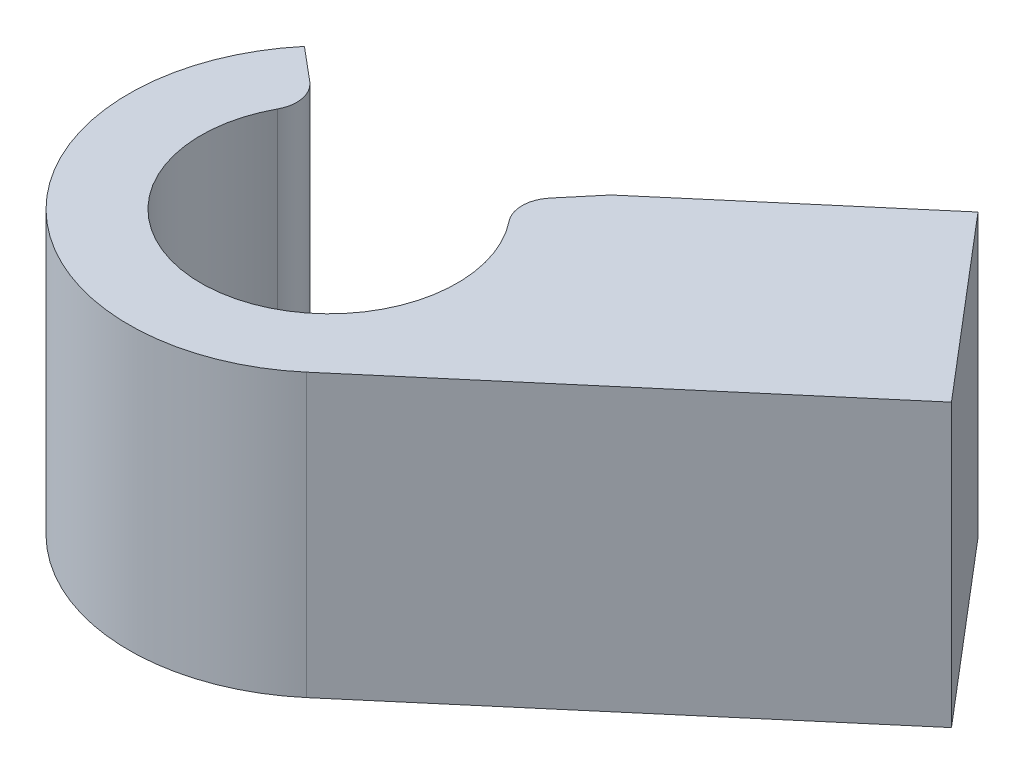
ISO-10303-21;
HEADER;
FILE_DESCRIPTION(('STEP AP214'),'2;1');
FILE_NAME('part.step','',(''),(''),'','','');
FILE_SCHEMA(('AUTOMOTIVE_DESIGN { 1 0 10303 214 1 1 1 1 }'));
ENDSEC;
DATA;
#1=APPLICATION_CONTEXT('core data for automotive mechanical design processes');
#2=APPLICATION_PROTOCOL_DEFINITION('international standard','automotive_design',2000,#1);
#3=PRODUCT_CONTEXT('',#1,'mechanical');
#4=PRODUCT('Part','Part','',(#3));
#5=PRODUCT_RELATED_PRODUCT_CATEGORY('part','',(#4));
#6=PRODUCT_DEFINITION_FORMATION('','',#4);
#7=PRODUCT_DEFINITION_CONTEXT('part definition',#1,'design');
#8=PRODUCT_DEFINITION('design','',#6,#7);
#9=PRODUCT_DEFINITION_SHAPE('','',#8);
#10=(LENGTH_UNIT() NAMED_UNIT(*) SI_UNIT(.MILLI.,.METRE.));
#11=(NAMED_UNIT(*) PLANE_ANGLE_UNIT() SI_UNIT($,.RADIAN.));
#12=(NAMED_UNIT(*) SI_UNIT($,.STERADIAN.) SOLID_ANGLE_UNIT());
#13=UNCERTAINTY_MEASURE_WITH_UNIT(LENGTH_MEASURE(1.E-05),#10,'distance_accuracy_value','');
#14=(GEOMETRIC_REPRESENTATION_CONTEXT(3) GLOBAL_UNCERTAINTY_ASSIGNED_CONTEXT((#13)) GLOBAL_UNIT_ASSIGNED_CONTEXT((#10,
#11,#12)) REPRESENTATION_CONTEXT('',''));
#15=CARTESIAN_POINT('',(0.,0.,0.));
#16=DIRECTION('',(0.,0.,1.));
#17=DIRECTION('',(1.,0.,0.));
#18=AXIS2_PLACEMENT_3D('',#15,#16,#17);
#19=CARTESIAN_POINT('',(0.,17.6,0.));
#20=DIRECTION('',(0.,-1.,0.));
#21=DIRECTION('',(0.,0.,-1.));
#22=AXIS2_PLACEMENT_3D('',#19,#20,#21);
#23=CYLINDRICAL_SURFACE('',#22,12.5);
#24=DIRECTION('',(0.,1.,0.));
#25=VECTOR('',#24,1.);
#26=CARTESIAN_POINT('',(8.10037181798933,0.,9.52018783482365));
#27=LINE('',#26,#25);
#28=CARTESIAN_POINT('',(8.10037181798933,0.,9.52018783482365));
#29=VERTEX_POINT('',#28);
#30=CARTESIAN_POINT('',(8.10037181798933,17.6,9.52018783482365));
#31=VERTEX_POINT('',#30);
#32=EDGE_CURVE('E152',#29,#31,#27,.T.);
#33=ORIENTED_EDGE('',*,*,#32,.T.);
#34=CARTESIAN_POINT('',(0.,17.6,0.));
#35=DIRECTION('',(0.,1.,0.));
#36=DIRECTION('',(0.,0.,1.));
#37=AXIS2_PLACEMENT_3D('',#34,#35,#36);
#38=CIRCLE('',#37,12.5);
#39=CARTESIAN_POINT('',(-9.57555553898724,17.6,-8.03484512108172));
#40=VERTEX_POINT('',#39);
#41=EDGE_CURVE('E212',#40,#31,#38,.T.);
#42=ORIENTED_EDGE('',*,*,#41,.F.);
#43=DIRECTION('',(0.,1.,0.));
#44=VECTOR('',#43,1.);
#45=CARTESIAN_POINT('',(-9.57555553898724,0.,-8.03484512108172));
#46=LINE('',#45,#44);
#47=CARTESIAN_POINT('',(-9.57555553898724,0.,-8.03484512108172));
#48=VERTEX_POINT('',#47);
#49=EDGE_CURVE('E188',#48,#40,#46,.T.);
#50=ORIENTED_EDGE('',*,*,#49,.F.);
#51=CARTESIAN_POINT('',(0.,0.,0.));
#52=DIRECTION('',(0.,1.,0.));
#53=DIRECTION('',(0.,0.,1.));
#54=AXIS2_PLACEMENT_3D('',#51,#52,#53);
#55=CIRCLE('',#54,12.5);
#56=EDGE_CURVE('E217',#48,#29,#55,.T.);
#57=ORIENTED_EDGE('',*,*,#56,.T.);
#58=EDGE_LOOP('',(#33,#42,#50,#57));
#59=FACE_BOUND('',#58,.T.);
#60=ADVANCED_FACE('F43',(#59),#23,.T.);
#61=CARTESIAN_POINT('',(0.,17.6,0.));
#62=DIRECTION('',(0.,1.,0.));
#63=DIRECTION('',(0.,0.,1.));
#64=AXIS2_PLACEMENT_3D('',#61,#62,#63);
#65=PLANE('',#64);
#66=CARTESIAN_POINT('',(0.,17.6,0.));
#67=DIRECTION('',(0.,1.,0.));
#68=DIRECTION('',(0.,0.,1.));
#69=AXIS2_PLACEMENT_3D('',#66,#67,#68);
#70=CIRCLE('',#69,8.);
#71=CARTESIAN_POINT('',(-7.03299779449363,17.6,-3.81273419249857));
#72=VERTEX_POINT('',#71);
#73=CARTESIAN_POINT('',(6.26407641047932,17.6,-4.97607744349669));
#74=VERTEX_POINT('',#73);
#75=EDGE_CURVE('E192',#72,#74,#70,.T.);
#76=ORIENTED_EDGE('',*,*,#75,.F.);
#77=CARTESIAN_POINT('',(-8.79124724311704,17.6,-4.76591774062321));
#78=DIRECTION('',(0.,1.,0.));
#79=DIRECTION('',(0.,0.,1.));
#80=AXIS2_PLACEMENT_3D('',#77,#78,#79);
#81=CIRCLE('',#80,2.);
#82=CARTESIAN_POINT('',(-7.50567202374397,17.6,-6.29800662686116));
#83=VERTEX_POINT('',#82);
#84=EDGE_CURVE('E243',#72,#83,#81,.T.);
#85=ORIENTED_EDGE('',*,*,#84,.T.);
#86=DIRECTION('',(-0.766044443118979,0.,-0.642787609686538));
#87=VECTOR('',#86,1.);
#88=CARTESIAN_POINT('',(0.,17.6,0.));
#89=LINE('',#88,#87);
#90=EDGE_CURVE('E169',#83,#40,#89,.T.);
#91=ORIENTED_EDGE('',*,*,#90,.T.);
#92=ORIENTED_EDGE('',*,*,#41,.T.);
#93=DIRECTION('',(0.761615026785892,0.,-0.648029745439146));
#94=VECTOR('',#93,1.);
#95=CARTESIAN_POINT('',(8.10037181798933,17.6,9.52018783482365));
#96=LINE('',#95,#94);
#97=CARTESIAN_POINT('',(29.8635212083962,17.6,-8.99726214109996));
#98=VERTEX_POINT('',#97);
#99=EDGE_CURVE('E162',#31,#98,#96,.T.);
#100=ORIENTED_EDGE('',*,*,#99,.T.);
#101=DIRECTION('',(-0.648029745439146,0.,-0.761615026785892));
#102=VECTOR('',#101,1.);
#103=CARTESIAN_POINT('',(21.7631493904069,17.6,-18.5174499759236));
#104=LINE('',#103,#102);
#105=CARTESIAN_POINT('',(20.4113150486798,17.6,-20.1062309780779));
#106=VERTEX_POINT('',#105);
#107=EDGE_CURVE('E129',#98,#106,#104,.T.);
#108=ORIENTED_EDGE('',*,*,#107,.T.);
#109=DIRECTION('',(-0.761615026785892,0.,0.648029745439146));
#110=VECTOR('',#109,1.);
#111=CARTESIAN_POINT('',(-1.35183434172712,17.6,-1.58878100215428));
#112=LINE('',#111,#110);
#113=CARTESIAN_POINT('',(8.03484512108176,17.6,-9.57555553898721));
#114=VERTEX_POINT('',#113);
#115=EDGE_CURVE('E154',#106,#114,#112,.T.);
#116=ORIENTED_EDGE('',*,*,#115,.T.);
#117=DIRECTION('',(0.642787609686541,0.,-0.766044443118977));
#118=VECTOR('',#117,1.);
#119=CARTESIAN_POINT('',(0.,17.6,0.));
#120=LINE('',#119,#118);
#121=CARTESIAN_POINT('',(6.29800662686119,17.6,-7.50567202374394));
#122=VERTEX_POINT('',#121);
#123=EDGE_CURVE('E176',#122,#114,#120,.T.);
#124=ORIENTED_EDGE('',*,*,#123,.F.);
#125=CARTESIAN_POINT('',(7.83009551309915,17.6,-6.22009680437086));
#126=DIRECTION('',(0.,1.,0.));
#127=DIRECTION('',(0.,0.,1.));
#128=AXIS2_PLACEMENT_3D('',#125,#126,#127);
#129=CIRCLE('',#128,2.);
#130=EDGE_CURVE('E240',#122,#74,#129,.T.);
#131=ORIENTED_EDGE('',*,*,#130,.T.);
#132=EDGE_LOOP('',(#76,#85,#91,#92,#100,#108,#116,#124,#131));
#133=FACE_BOUND('',#132,.T.);
#134=ADVANCED_FACE('F267',(#133),#65,.T.);
#135=CARTESIAN_POINT('',(0.,-22.6274169979695,0.));
#136=DIRECTION('',(0.,1.,0.));
#137=DIRECTION('',(0.,0.,1.));
#138=AXIS2_PLACEMENT_3D('',#135,#136,#137);
#139=CYLINDRICAL_SURFACE('',#138,8.);
#140=CARTESIAN_POINT('',(0.,2.,0.));
#141=DIRECTION('',(0.,1.,0.));
#142=DIRECTION('',(0.,0.,1.));
#143=AXIS2_PLACEMENT_3D('',#140,#141,#142);
#144=CIRCLE('',#143,8.);
#145=CARTESIAN_POINT('',(6.26407641047932,2.,-4.97607744349669));
#146=VERTEX_POINT('',#145);
#147=CARTESIAN_POINT('',(-7.03299779449363,2.,-3.81273419249857));
#148=VERTEX_POINT('',#147);
#149=EDGE_CURVE('E206',#146,#148,#144,.F.);
#150=ORIENTED_EDGE('',*,*,#149,.T.);
#151=DIRECTION('',(0.,1.,0.));
#152=VECTOR('',#151,1.);
#153=CARTESIAN_POINT('',(-7.03299779449363,-22.6274169979695,-3.81273419249856));
#154=LINE('',#153,#152);
#155=EDGE_CURVE('E237',#148,#72,#154,.T.);
#156=ORIENTED_EDGE('',*,*,#155,.T.);
#157=ORIENTED_EDGE('',*,*,#75,.T.);
#158=DIRECTION('',(0.,1.,0.));
#159=VECTOR('',#158,1.);
#160=CARTESIAN_POINT('',(6.26407641047932,-22.6274169979695,-4.97607744349669));
#161=LINE('',#160,#159);
#162=EDGE_CURVE('E233',#74,#146,#161,.F.);
#163=ORIENTED_EDGE('',*,*,#162,.T.);
#164=EDGE_LOOP('',(#150,#156,#157,#163));
#165=FACE_BOUND('',#164,.T.);
#166=ADVANCED_FACE('F259',(#165),#139,.F.);
#167=CARTESIAN_POINT('',(0.,-33.2,0.));
#168=DIRECTION('',(0.,1.,0.));
#169=DIRECTION('',(0.,0.,1.));
#170=AXIS2_PLACEMENT_3D('',#167,#168,#169);
#171=CYLINDRICAL_SURFACE('',#170,5.5);
#172=CARTESIAN_POINT('',(0.,0.,0.));
#173=DIRECTION('',(0.,1.,0.));
#174=DIRECTION('',(0.,0.,1.));
#175=AXIS2_PLACEMENT_3D('',#172,#173,#174);
#176=CIRCLE('',#175,5.5);
#177=CARTESIAN_POINT('',(0.,0.,5.5));
#178=VERTEX_POINT('',#177);
#179=EDGE_CURVE('E220',#178,#178,#176,.T.);
#180=ORIENTED_EDGE('',*,*,#179,.F.);
#181=EDGE_LOOP('',(#180));
#182=FACE_BOUND('',#181,.T.);
#183=CARTESIAN_POINT('',(0.,2.,0.));
#184=DIRECTION('',(0.,1.,0.));
#185=DIRECTION('',(0.,0.,1.));
#186=AXIS2_PLACEMENT_3D('',#183,#184,#185);
#187=CIRCLE('',#186,5.5);
#188=CARTESIAN_POINT('',(0.,2.,5.5));
#189=VERTEX_POINT('',#188);
#190=EDGE_CURVE('E211',#189,#189,#187,.F.);
#191=ORIENTED_EDGE('',*,*,#190,.F.);
#192=EDGE_LOOP('',(#191));
#193=FACE_BOUND('',#192,.T.);
#194=ADVANCED_FACE('F298',(#182,#193),#171,.F.);
#195=CARTESIAN_POINT('',(0.,0.,0.));
#196=DIRECTION('',(0.,1.,0.));
#197=DIRECTION('',(0.,0.,1.));
#198=AXIS2_PLACEMENT_3D('',#195,#196,#197);
#199=PLANE('',#198);
#200=DIRECTION('',(-0.766044443118979,0.,-0.642787609686538));
#201=VECTOR('',#200,1.);
#202=CARTESIAN_POINT('',(0.,0.,0.));
#203=LINE('',#202,#201);
#204=CARTESIAN_POINT('',(-6.12835554495183,0.,-5.1423008774923));
#205=VERTEX_POINT('',#204);
#206=EDGE_CURVE('E172',#205,#48,#203,.T.);
#207=ORIENTED_EDGE('',*,*,#206,.F.);
#208=CARTESIAN_POINT('',(0.,0.,0.));
#209=DIRECTION('',(0.,1.,0.));
#210=DIRECTION('',(0.,0.,1.));
#211=AXIS2_PLACEMENT_3D('',#208,#209,#210);
#212=CIRCLE('',#211,8.);
#213=CARTESIAN_POINT('',(5.14230087749233,0.,-6.12835554495182));
#214=VERTEX_POINT('',#213);
#215=EDGE_CURVE('E175',#205,#214,#212,.F.);
#216=ORIENTED_EDGE('',*,*,#215,.T.);
#217=DIRECTION('',(0.642787609686541,0.,-0.766044443118977));
#218=VECTOR('',#217,1.);
#219=CARTESIAN_POINT('',(0.,0.,0.));
#220=LINE('',#219,#218);
#221=CARTESIAN_POINT('',(8.03484512108176,0.,-9.57555553898721));
#222=VERTEX_POINT('',#221);
#223=EDGE_CURVE('E180',#214,#222,#220,.T.);
#224=ORIENTED_EDGE('',*,*,#223,.T.);
#225=DIRECTION('',(-0.761615026785892,0.,0.648029745439146));
#226=VECTOR('',#225,1.);
#227=CARTESIAN_POINT('',(-1.35183434172712,0.,-1.58878100215428));
#228=LINE('',#227,#226);
#229=CARTESIAN_POINT('',(20.4113150486798,0.,-20.1062309780779));
#230=VERTEX_POINT('',#229);
#231=EDGE_CURVE('E136',#230,#222,#228,.T.);
#232=ORIENTED_EDGE('',*,*,#231,.F.);
#233=DIRECTION('',(-0.648029745439146,0.,-0.761615026785892));
#234=VECTOR('',#233,1.);
#235=CARTESIAN_POINT('',(21.7631493904069,0.,-18.5174499759236));
#236=LINE('',#235,#234);
#237=CARTESIAN_POINT('',(29.8635212083962,0.,-8.99726214109996));
#238=VERTEX_POINT('',#237);
#239=EDGE_CURVE('E127',#238,#230,#236,.T.);
#240=ORIENTED_EDGE('',*,*,#239,.F.);
#241=DIRECTION('',(0.761615026785892,0.,-0.648029745439146));
#242=VECTOR('',#241,1.);
#243=CARTESIAN_POINT('',(8.10037181798933,0.,9.52018783482365));
#244=LINE('',#243,#242);
#245=EDGE_CURVE('E145',#29,#238,#244,.T.);
#246=ORIENTED_EDGE('',*,*,#245,.F.);
#247=ORIENTED_EDGE('',*,*,#56,.F.);
#248=EDGE_LOOP('',(#207,#216,#224,#232,#240,#246,#247));
#249=FACE_BOUND('',#248,.T.);
#250=ORIENTED_EDGE('',*,*,#179,.T.);
#251=EDGE_LOOP('',(#250));
#252=FACE_BOUND('',#251,.T.);
#253=ADVANCED_FACE('F142',(#249,#252),#199,.F.);
#254=CARTESIAN_POINT('',(0.,2.,0.));
#255=DIRECTION('',(0.,1.,0.));
#256=DIRECTION('',(0.,0.,1.));
#257=AXIS2_PLACEMENT_3D('',#254,#255,#256);
#258=PLANE('',#257);
#259=CARTESIAN_POINT('',(-6.12835554495183,2.,-5.1423008774923));
#260=VERTEX_POINT('',#259);
#261=CARTESIAN_POINT('',(5.14230087749232,2.,-6.12835554495182));
#262=VERTEX_POINT('',#261);
#263=EDGE_CURVE('E207',#260,#262,#144,.F.);
#264=ORIENTED_EDGE('',*,*,#263,.F.);
#265=DIRECTION('',(0.766044443118979,0.,0.642787609686538));
#266=VECTOR('',#265,1.);
#267=CARTESIAN_POINT('',(0.,2.,0.));
#268=LINE('',#267,#266);
#269=CARTESIAN_POINT('',(-7.50567202374396,2.,-6.29800662686116));
#270=VERTEX_POINT('',#269);
#271=EDGE_CURVE('E216',#270,#260,#268,.T.);
#272=ORIENTED_EDGE('',*,*,#271,.F.);
#273=CARTESIAN_POINT('',(-8.79124724311704,2.,-4.76591774062321));
#274=DIRECTION('',(0.,1.,0.));
#275=DIRECTION('',(0.,0.,1.));
#276=AXIS2_PLACEMENT_3D('',#273,#274,#275);
#277=CIRCLE('',#276,2.);
#278=EDGE_CURVE('E52',#270,#148,#277,.F.);
#279=ORIENTED_EDGE('',*,*,#278,.T.);
#280=ORIENTED_EDGE('',*,*,#149,.F.);
#281=CARTESIAN_POINT('',(7.83009551309915,2.,-6.22009680437086));
#282=DIRECTION('',(0.,1.,0.));
#283=DIRECTION('',(0.,0.,1.));
#284=AXIS2_PLACEMENT_3D('',#281,#282,#283);
#285=CIRCLE('',#284,2.);
#286=CARTESIAN_POINT('',(6.29800662686119,2.,-7.50567202374394));
#287=VERTEX_POINT('',#286);
#288=EDGE_CURVE('E12',#146,#287,#285,.F.);
#289=ORIENTED_EDGE('',*,*,#288,.T.);
#290=DIRECTION('',(0.642787609686541,0.,-0.766044443118977));
#291=VECTOR('',#290,1.);
#292=CARTESIAN_POINT('',(0.,2.,0.));
#293=LINE('',#292,#291);
#294=EDGE_CURVE('E58',#262,#287,#293,.T.);
#295=ORIENTED_EDGE('',*,*,#294,.F.);
#296=EDGE_LOOP('',(#264,#272,#279,#280,#289,#295));
#297=FACE_BOUND('',#296,.T.);
#298=ORIENTED_EDGE('',*,*,#190,.T.);
#299=EDGE_LOOP('',(#298));
#300=FACE_BOUND('',#299,.T.);
#301=ADVANCED_FACE('F253',(#297,#300),#258,.T.);
#302=CARTESIAN_POINT('',(0.,0.,0.));
#303=DIRECTION('',(0.642787609686538,0.,-0.766044443118979));
#304=DIRECTION('',(-0.766044443118979,0.,-0.642787609686538));
#305=AXIS2_PLACEMENT_3D('',#302,#303,#304);
#306=PLANE('',#305);
#307=ORIENTED_EDGE('',*,*,#90,.F.);
#308=DIRECTION('',(0.,-1.,0.));
#309=VECTOR('',#308,1.);
#310=CARTESIAN_POINT('',(-7.50567202374396,1.99999999999999,-6.29800662686116));
#311=LINE('',#310,#309);
#312=EDGE_CURVE('E229',#83,#270,#311,.T.);
#313=ORIENTED_EDGE('',*,*,#312,.T.);
#314=ORIENTED_EDGE('',*,*,#271,.T.);
#315=DIRECTION('',(0.,1.,0.));
#316=VECTOR('',#315,1.);
#317=CARTESIAN_POINT('',(-6.12835554495183,0.,-5.1423008774923));
#318=LINE('',#317,#316);
#319=EDGE_CURVE('E183',#205,#260,#318,.T.);
#320=ORIENTED_EDGE('',*,*,#319,.F.);
#321=ORIENTED_EDGE('',*,*,#206,.T.);
#322=ORIENTED_EDGE('',*,*,#49,.T.);
#323=EDGE_LOOP('',(#307,#313,#314,#320,#321,#322));
#324=FACE_BOUND('',#323,.T.);
#325=ADVANCED_FACE('F269',(#324),#306,.T.);
#326=CARTESIAN_POINT('',(0.,0.,0.));
#327=DIRECTION('',(0.766044443118977,0.,0.642787609686541));
#328=DIRECTION('',(0.642787609686541,0.,-0.766044443118977));
#329=AXIS2_PLACEMENT_3D('',#326,#327,#328);
#330=PLANE('',#329);
#331=DIRECTION('',(0.,1.,0.));
#332=VECTOR('',#331,1.);
#333=CARTESIAN_POINT('',(5.14230087749233,0.,-6.12835554495182));
#334=LINE('',#333,#332);
#335=EDGE_CURVE('E197',#214,#262,#334,.T.);
#336=ORIENTED_EDGE('',*,*,#335,.T.);
#337=ORIENTED_EDGE('',*,*,#294,.T.);
#338=DIRECTION('',(0.,1.,0.));
#339=VECTOR('',#338,1.);
#340=CARTESIAN_POINT('',(6.29800662686119,0.,-7.50567202374394));
#341=LINE('',#340,#339);
#342=EDGE_CURVE('E246',#287,#122,#341,.T.);
#343=ORIENTED_EDGE('',*,*,#342,.T.);
#344=ORIENTED_EDGE('',*,*,#123,.T.);
#345=DIRECTION('',(0.,1.,0.));
#346=VECTOR('',#345,1.);
#347=CARTESIAN_POINT('',(8.03484512108176,0.,-9.57555553898721));
#348=LINE('',#347,#346);
#349=EDGE_CURVE('E193',#222,#114,#348,.T.);
#350=ORIENTED_EDGE('',*,*,#349,.F.);
#351=ORIENTED_EDGE('',*,*,#223,.F.);
#352=EDGE_LOOP('',(#336,#337,#343,#344,#350,#351));
#353=FACE_BOUND('',#352,.T.);
#354=ADVANCED_FACE('F280',(#353),#330,.F.);
#355=CARTESIAN_POINT('',(0.,0.,0.));
#356=DIRECTION('',(0.,1.,0.));
#357=DIRECTION('',(0.,0.,1.));
#358=AXIS2_PLACEMENT_3D('',#355,#356,#357);
#359=CYLINDRICAL_SURFACE('',#358,8.);
#360=ORIENTED_EDGE('',*,*,#263,.T.);
#361=ORIENTED_EDGE('',*,*,#335,.F.);
#362=ORIENTED_EDGE('',*,*,#215,.F.);
#363=ORIENTED_EDGE('',*,*,#319,.T.);
#364=EDGE_LOOP('',(#360,#361,#362,#363));
#365=FACE_BOUND('',#364,.T.);
#366=ADVANCED_FACE('F283',(#365),#359,.T.);
#367=CARTESIAN_POINT('',(8.10037181798933,0.,9.52018783482365));
#368=DIRECTION('',(0.648029745439146,0.,0.761615026785892));
#369=DIRECTION('',(0.761615026785892,0.,-0.648029745439146));
#370=AXIS2_PLACEMENT_3D('',#367,#368,#369);
#371=PLANE('',#370);
#372=ORIENTED_EDGE('',*,*,#99,.F.);
#373=ORIENTED_EDGE('',*,*,#32,.F.);
#374=ORIENTED_EDGE('',*,*,#245,.T.);
#375=DIRECTION('',(0.,1.,0.));
#376=VECTOR('',#375,1.);
#377=CARTESIAN_POINT('',(29.8635212083962,0.,-8.99726214109996));
#378=LINE('',#377,#376);
#379=EDGE_CURVE('E124',#238,#98,#378,.T.);
#380=ORIENTED_EDGE('',*,*,#379,.T.);
#381=EDGE_LOOP('',(#372,#373,#374,#380));
#382=FACE_BOUND('',#381,.T.);
#383=ADVANCED_FACE('F151',(#382),#371,.T.);
#384=CARTESIAN_POINT('',(-1.35183434172712,0.,-1.58878100215428));
#385=DIRECTION('',(-0.648029745439146,0.,-0.761615026785892));
#386=DIRECTION('',(-0.761615026785892,0.,0.648029745439146));
#387=AXIS2_PLACEMENT_3D('',#384,#385,#386);
#388=PLANE('',#387);
#389=ORIENTED_EDGE('',*,*,#115,.F.);
#390=DIRECTION('',(0.,1.,0.));
#391=VECTOR('',#390,1.);
#392=CARTESIAN_POINT('',(20.4113150486798,0.,-20.1062309780779));
#393=LINE('',#392,#391);
#394=EDGE_CURVE('E135',#230,#106,#393,.T.);
#395=ORIENTED_EDGE('',*,*,#394,.F.);
#396=ORIENTED_EDGE('',*,*,#231,.T.);
#397=ORIENTED_EDGE('',*,*,#349,.T.);
#398=EDGE_LOOP('',(#389,#395,#396,#397));
#399=FACE_BOUND('',#398,.T.);
#400=ADVANCED_FACE('F277',(#399),#388,.T.);
#401=CARTESIAN_POINT('',(21.7631493904069,0.,-18.5174499759236));
#402=DIRECTION('',(0.761615026785892,0.,-0.648029745439146));
#403=DIRECTION('',(-0.648029745439146,0.,-0.761615026785892));
#404=AXIS2_PLACEMENT_3D('',#401,#402,#403);
#405=PLANE('',#404);
#406=ORIENTED_EDGE('',*,*,#107,.F.);
#407=ORIENTED_EDGE('',*,*,#379,.F.);
#408=ORIENTED_EDGE('',*,*,#239,.T.);
#409=ORIENTED_EDGE('',*,*,#394,.T.);
#410=EDGE_LOOP('',(#406,#407,#408,#409));
#411=FACE_BOUND('',#410,.T.);
#412=ADVANCED_FACE('F126',(#411),#405,.T.);
#413=CARTESIAN_POINT('',(-8.79124724311704,-22.6274169979695,-4.76591774062321));
#414=DIRECTION('',(0.,1.,0.));
#415=DIRECTION('',(0.,0.,1.));
#416=AXIS2_PLACEMENT_3D('',#413,#414,#415);
#417=CYLINDRICAL_SURFACE('',#416,2.);
#418=ORIENTED_EDGE('',*,*,#84,.F.);
#419=ORIENTED_EDGE('',*,*,#155,.F.);
#420=ORIENTED_EDGE('',*,*,#278,.F.);
#421=ORIENTED_EDGE('',*,*,#312,.F.);
#422=EDGE_LOOP('',(#418,#419,#420,#421));
#423=FACE_BOUND('',#422,.T.);
#424=ADVANCED_FACE('F264',(#423),#417,.T.);
#425=CARTESIAN_POINT('',(7.83009551309915,-22.6274169979695,-6.22009680437086));
#426=DIRECTION('',(0.,1.,0.));
#427=DIRECTION('',(0.,0.,1.));
#428=AXIS2_PLACEMENT_3D('',#425,#426,#427);
#429=CYLINDRICAL_SURFACE('',#428,2.);
#430=ORIENTED_EDGE('',*,*,#130,.F.);
#431=ORIENTED_EDGE('',*,*,#342,.F.);
#432=ORIENTED_EDGE('',*,*,#288,.F.);
#433=ORIENTED_EDGE('',*,*,#162,.F.);
#434=EDGE_LOOP('',(#430,#431,#432,#433));
#435=FACE_BOUND('',#434,.T.);
#436=ADVANCED_FACE('F45',(#435),#429,.T.);
#437=CLOSED_SHELL('',(#60,#134,#166,#194,#253,#301,#325,#354,#366,#383,#400,#412,#424,#436));
#438=MANIFOLD_SOLID_BREP('B2',#437);
#439=ADVANCED_BREP_SHAPE_REPRESENTATION('',(#18,#438),#14);
#440=SHAPE_DEFINITION_REPRESENTATION(#9,#439);
ENDSEC;
END-ISO-10303-21;
